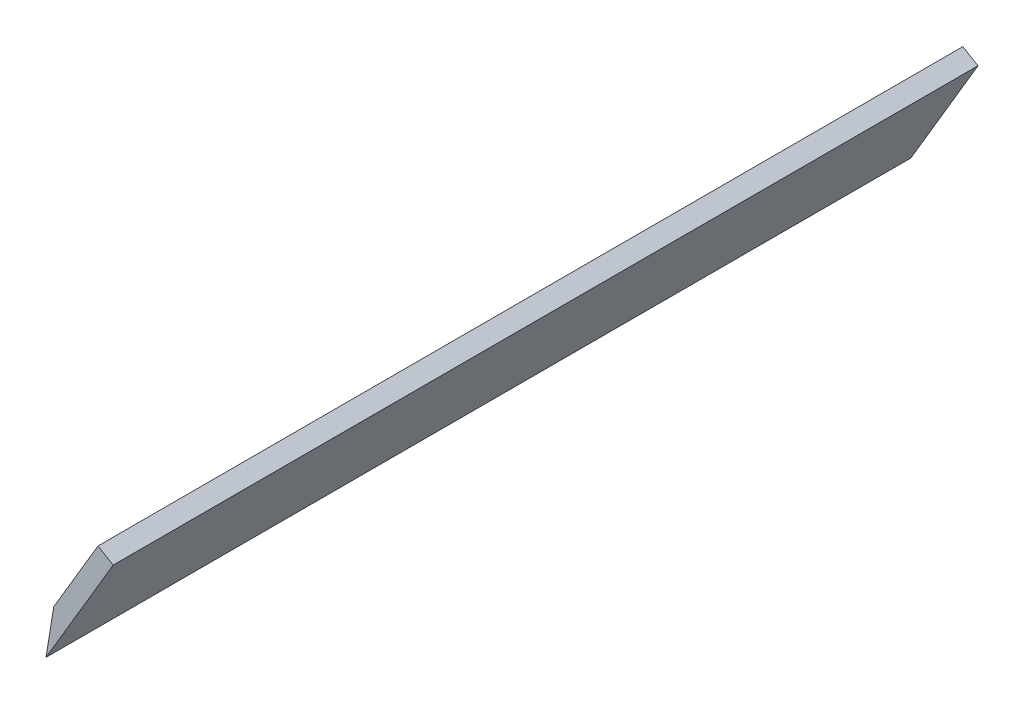
ISO-10303-21;
HEADER;
FILE_DESCRIPTION(('STEP AP214'),'2;1');
FILE_NAME('part.step','',(''),(''),'','','');
FILE_SCHEMA(('AUTOMOTIVE_DESIGN { 1 0 10303 214 1 1 1 1 }'));
ENDSEC;
DATA;
#1=APPLICATION_CONTEXT('core data for automotive mechanical design processes');
#2=APPLICATION_PROTOCOL_DEFINITION('international standard','automotive_design',2000,#1);
#3=PRODUCT_CONTEXT('',#1,'mechanical');
#4=PRODUCT('Part','Part','',(#3));
#5=PRODUCT_RELATED_PRODUCT_CATEGORY('part','',(#4));
#6=PRODUCT_DEFINITION_FORMATION('','',#4);
#7=PRODUCT_DEFINITION_CONTEXT('part definition',#1,'design');
#8=PRODUCT_DEFINITION('design','',#6,#7);
#9=PRODUCT_DEFINITION_SHAPE('','',#8);
#10=(LENGTH_UNIT() NAMED_UNIT(*) SI_UNIT(.MILLI.,.METRE.));
#11=(NAMED_UNIT(*) PLANE_ANGLE_UNIT() SI_UNIT($,.RADIAN.));
#12=(NAMED_UNIT(*) SI_UNIT($,.STERADIAN.) SOLID_ANGLE_UNIT());
#13=UNCERTAINTY_MEASURE_WITH_UNIT(LENGTH_MEASURE(1.E-05),#10,'distance_accuracy_value','');
#14=(GEOMETRIC_REPRESENTATION_CONTEXT(3) GLOBAL_UNCERTAINTY_ASSIGNED_CONTEXT((#13)) GLOBAL_UNIT_ASSIGNED_CONTEXT((#10,
#11,#12)) REPRESENTATION_CONTEXT('',''));
#15=CARTESIAN_POINT('',(0.,0.,0.));
#16=DIRECTION('',(0.,0.,1.));
#17=DIRECTION('',(1.,0.,0.));
#18=AXIS2_PLACEMENT_3D('',#15,#16,#17);
#19=CARTESIAN_POINT('',(-1.72116236717633,1.01862657820026,98.));
#20=DIRECTION('',(-0.509313289100128,-0.860581183588166,0.));
#21=DIRECTION('',(0.860581183588166,-0.509313289100128,0.));
#22=AXIS2_PLACEMENT_3D('',#19,#20,#21);
#23=PLANE('',#22);
#24=DIRECTION('',(-0.860581183588166,0.509313289100128,0.));
#25=VECTOR('',#24,1.);
#26=CARTESIAN_POINT('',(-1.72116236717633,1.01862657820026,0.));
#27=LINE('',#26,#25);
#28=CARTESIAN_POINT('',(0.,0.,0.));
#29=VERTEX_POINT('',#28);
#30=CARTESIAN_POINT('',(-1.72116236717633,1.01862657820026,0.));
#31=VERTEX_POINT('',#30);
#32=EDGE_CURVE('E84',#29,#31,#27,.T.);
#33=ORIENTED_EDGE('',*,*,#32,.T.);
#34=DIRECTION('',(0.,0.,-1.));
#35=VECTOR('',#34,1.);
#36=CARTESIAN_POINT('',(-1.72116236717633,1.01862657820026,98.));
#37=LINE('',#36,#35);
#38=CARTESIAN_POINT('',(-1.72116236717633,1.01862657820026,98.));
#39=VERTEX_POINT('',#38);
#40=EDGE_CURVE('E11',#39,#31,#37,.T.);
#41=ORIENTED_EDGE('',*,*,#40,.F.);
#42=DIRECTION('',(-0.860581183588166,0.509313289100128,0.));
#43=VECTOR('',#42,1.);
#44=CARTESIAN_POINT('',(-1.72116236717633,1.01862657820026,98.));
#45=LINE('',#44,#43);
#46=CARTESIAN_POINT('',(0.,0.,98.));
#47=VERTEX_POINT('',#46);
#48=EDGE_CURVE('E78',#47,#39,#45,.T.);
#49=ORIENTED_EDGE('',*,*,#48,.F.);
#50=DIRECTION('',(0.,0.,-1.));
#51=VECTOR('',#50,1.);
#52=CARTESIAN_POINT('',(0.,0.,98.));
#53=LINE('',#52,#51);
#54=EDGE_CURVE('E74',#47,#29,#53,.T.);
#55=ORIENTED_EDGE('',*,*,#54,.T.);
#56=EDGE_LOOP('',(#33,#41,#49,#55));
#57=FACE_BOUND('',#56,.T.);
#58=ADVANCED_FACE('F35',(#57),#23,.F.);
#59=CARTESIAN_POINT('',(-9.33156642398962,-11.8405912567952,98.));
#60=DIRECTION('',(0.860581183588166,-0.509313289100128,0.));
#61=DIRECTION('',(0.509313289100128,0.860581183588166,0.));
#62=AXIS2_PLACEMENT_3D('',#59,#60,#61);
#63=PLANE('',#62);
#64=DIRECTION('',(-0.509313289100128,-0.860581183588166,0.));
#65=VECTOR('',#64,1.);
#66=CARTESIAN_POINT('',(-9.33156642398962,-11.8405912567952,0.));
#67=LINE('',#66,#65);
#68=CARTESIAN_POINT('',(-6.7357450148565,-7.45445975686469,0.));
#69=VERTEX_POINT('',#68);
#70=EDGE_CURVE('E79',#31,#69,#67,.T.);
#71=ORIENTED_EDGE('',*,*,#70,.T.);
#72=DIRECTION('',(0.,0.,-1.));
#73=VECTOR('',#72,1.);
#74=CARTESIAN_POINT('',(-6.7357450148565,-7.45445975686469,108.));
#75=LINE('',#74,#73);
#76=CARTESIAN_POINT('',(-6.7357450148565,-7.45445975686469,98.));
#77=VERTEX_POINT('',#76);
#78=EDGE_CURVE('E91',#77,#69,#75,.T.);
#79=ORIENTED_EDGE('',*,*,#78,.F.);
#80=DIRECTION('',(-0.509313289100128,-0.860581183588166,0.));
#81=VECTOR('',#80,1.);
#82=CARTESIAN_POINT('',(-9.33156642398962,-11.8405912567952,98.));
#83=LINE('',#82,#81);
#84=EDGE_CURVE('E95',#39,#77,#83,.T.);
#85=ORIENTED_EDGE('',*,*,#84,.F.);
#86=ORIENTED_EDGE('',*,*,#40,.T.);
#87=EDGE_LOOP('',(#71,#79,#85,#86));
#88=FACE_BOUND('',#87,.T.);
#89=ADVANCED_FACE('F107',(#88),#63,.F.);
#90=CARTESIAN_POINT('',(0.,0.,98.));
#91=DIRECTION('',(-0.860581183588166,0.509313289100129,0.));
#92=DIRECTION('',(-0.509313289100129,-0.860581183588166,0.));
#93=AXIS2_PLACEMENT_3D('',#90,#91,#92);
#94=PLANE('',#93);
#95=DIRECTION('',(0.509313289100129,0.860581183588166,0.));
#96=VECTOR('',#95,1.);
#97=CARTESIAN_POINT('',(0.,0.,0.));
#98=LINE('',#97,#96);
#99=CARTESIAN_POINT('',(-7.6104040568133,-12.8592178349955,0.));
#100=VERTEX_POINT('',#99);
#101=EDGE_CURVE('E71',#100,#29,#98,.T.);
#102=ORIENTED_EDGE('',*,*,#101,.T.);
#103=ORIENTED_EDGE('',*,*,#54,.F.);
#104=DIRECTION('',(0.509313289100129,0.860581183588166,0.));
#105=VECTOR('',#104,1.);
#106=CARTESIAN_POINT('',(0.,0.,98.));
#107=LINE('',#106,#105);
#108=CARTESIAN_POINT('',(-7.6104040568133,-12.8592178349955,98.));
#109=VERTEX_POINT('',#108);
#110=EDGE_CURVE('E51',#109,#47,#107,.T.);
#111=ORIENTED_EDGE('',*,*,#110,.F.);
#112=DIRECTION('',(0.,0.,-1.));
#113=VECTOR('',#112,1.);
#114=CARTESIAN_POINT('',(-7.6104040568133,-12.8592178349955,98.));
#115=LINE('',#114,#113);
#116=EDGE_CURVE('E43',#109,#100,#115,.T.);
#117=ORIENTED_EDGE('',*,*,#116,.T.);
#118=EDGE_LOOP('',(#102,#103,#111,#117));
#119=FACE_BOUND('',#118,.T.);
#120=ADVANCED_FACE('F73',(#119),#94,.F.);
#121=CARTESIAN_POINT('',(0.,0.,98.));
#122=DIRECTION('',(0.,0.,-1.));
#123=DIRECTION('',(-1.,0.,0.));
#124=AXIS2_PLACEMENT_3D('',#121,#122,#123);
#125=PLANE('',#124);
#126=ORIENTED_EDGE('',*,*,#84,.T.);
#127=DIRECTION('',(-0.15975290889891,-0.987157033150419,0.));
#128=VECTOR('',#127,1.);
#129=CARTESIAN_POINT('',(-5.38826481532339,0.87198991574666,98.));
#130=LINE('',#129,#128);
#131=EDGE_CURVE('E88',#77,#109,#130,.T.);
#132=ORIENTED_EDGE('',*,*,#131,.T.);
#133=ORIENTED_EDGE('',*,*,#110,.T.);
#134=ORIENTED_EDGE('',*,*,#48,.T.);
#135=EDGE_LOOP('',(#126,#132,#133,#134));
#136=FACE_BOUND('',#135,.T.);
#137=ADVANCED_FACE('F108',(#136),#125,.F.);
#138=CARTESIAN_POINT('',(0.,0.,0.));
#139=DIRECTION('',(0.,0.,-1.));
#140=DIRECTION('',(-1.,0.,0.));
#141=AXIS2_PLACEMENT_3D('',#138,#139,#140);
#142=PLANE('',#141);
#143=DIRECTION('',(-0.159752908898909,-0.987157033150419,0.));
#144=VECTOR('',#143,1.);
#145=CARTESIAN_POINT('',(-6.7357450148565,-7.45445975686469,0.));
#146=LINE('',#145,#144);
#147=EDGE_CURVE('E66',#69,#100,#146,.T.);
#148=ORIENTED_EDGE('',*,*,#147,.F.);
#149=ORIENTED_EDGE('',*,*,#70,.F.);
#150=ORIENTED_EDGE('',*,*,#32,.F.);
#151=ORIENTED_EDGE('',*,*,#101,.F.);
#152=EDGE_LOOP('',(#148,#149,#150,#151));
#153=FACE_BOUND('',#152,.T.);
#154=ADVANCED_FACE('F86',(#153),#142,.T.);
#155=CARTESIAN_POINT('',(-6.7357450148565,-7.45445975686469,108.));
#156=DIRECTION('',(0.987157033150419,-0.159752908898909,0.));
#157=DIRECTION('',(0.15975290889891,0.987157033150419,0.));
#158=AXIS2_PLACEMENT_3D('',#155,#156,#157);
#159=PLANE('',#158);
#160=ORIENTED_EDGE('',*,*,#78,.T.);
#161=ORIENTED_EDGE('',*,*,#147,.T.);
#162=ORIENTED_EDGE('',*,*,#116,.F.);
#163=ORIENTED_EDGE('',*,*,#131,.F.);
#164=EDGE_LOOP('',(#160,#161,#162,#163));
#165=FACE_BOUND('',#164,.T.);
#166=ADVANCED_FACE('F103',(#165),#159,.F.);
#167=CLOSED_SHELL('',(#58,#89,#120,#137,#154,#166));
#168=MANIFOLD_SOLID_BREP('B2',#167);
#169=ADVANCED_BREP_SHAPE_REPRESENTATION('',(#18,#168),#14);
#170=SHAPE_DEFINITION_REPRESENTATION(#9,#169);
ENDSEC;
END-ISO-10303-21;
